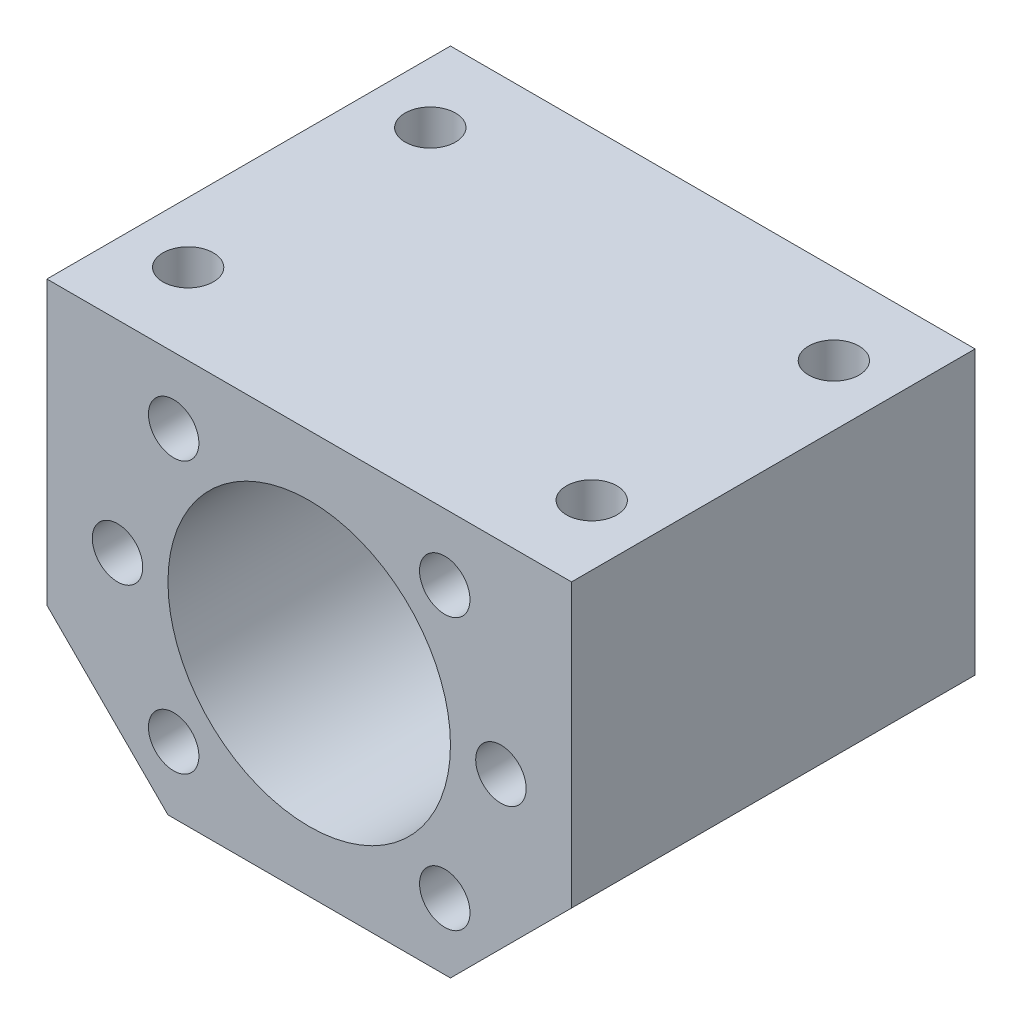
ISO-10303-21;
HEADER;
FILE_DESCRIPTION(('STEP AP214'),'2;1');
FILE_NAME('part.step','',(''),(''),'','','');
FILE_SCHEMA(('AUTOMOTIVE_DESIGN { 1 0 10303 214 1 1 1 1 }'));
ENDSEC;
DATA;
#1=APPLICATION_CONTEXT('core data for automotive mechanical design processes');
#2=APPLICATION_PROTOCOL_DEFINITION('international standard','automotive_design',2000,#1);
#3=PRODUCT_CONTEXT('',#1,'mechanical');
#4=PRODUCT('Part','Part','',(#3));
#5=PRODUCT_RELATED_PRODUCT_CATEGORY('part','',(#4));
#6=PRODUCT_DEFINITION_FORMATION('','',#4);
#7=PRODUCT_DEFINITION_CONTEXT('part definition',#1,'design');
#8=PRODUCT_DEFINITION('design','',#6,#7);
#9=PRODUCT_DEFINITION_SHAPE('','',#8);
#10=(LENGTH_UNIT() NAMED_UNIT(*) SI_UNIT(.MILLI.,.METRE.));
#11=(NAMED_UNIT(*) PLANE_ANGLE_UNIT() SI_UNIT($,.RADIAN.));
#12=(NAMED_UNIT(*) SI_UNIT($,.STERADIAN.) SOLID_ANGLE_UNIT());
#13=UNCERTAINTY_MEASURE_WITH_UNIT(LENGTH_MEASURE(1.E-05),#10,'distance_accuracy_value','');
#14=(GEOMETRIC_REPRESENTATION_CONTEXT(3) GLOBAL_UNCERTAINTY_ASSIGNED_CONTEXT((#13)) GLOBAL_UNIT_ASSIGNED_CONTEXT((#10,
#11,#12)) REPRESENTATION_CONTEXT('',''));
#15=CARTESIAN_POINT('',(0.,0.,0.));
#16=DIRECTION('',(0.,0.,1.));
#17=DIRECTION('',(1.,0.,0.));
#18=AXIS2_PLACEMENT_3D('',#15,#16,#17);
#19=CARTESIAN_POINT('',(0.,0.,40.));
#20=DIRECTION('',(0.,0.,1.));
#21=DIRECTION('',(1.,0.,0.));
#22=AXIS2_PLACEMENT_3D('',#19,#20,#21);
#23=PLANE('',#22);
#24=CARTESIAN_POINT('',(13.4350288425444,13.4350288425444,40.));
#25=DIRECTION('',(0.,0.,1.));
#26=DIRECTION('',(-1.,0.,0.));
#27=AXIS2_PLACEMENT_3D('',#24,#25,#26);
#28=CIRCLE('',#27,2.5);
#29=CARTESIAN_POINT('',(10.9350288425444,13.4350288425444,40.));
#30=VERTEX_POINT('',#29);
#31=EDGE_CURVE('E258',#30,#30,#28,.T.);
#32=ORIENTED_EDGE('',*,*,#31,.F.);
#33=EDGE_LOOP('',(#32));
#34=FACE_BOUND('',#33,.T.);
#35=CARTESIAN_POINT('',(-13.4350288425444,-13.4350288425444,40.));
#36=DIRECTION('',(0.,0.,1.));
#37=DIRECTION('',(-1.,0.,0.));
#38=AXIS2_PLACEMENT_3D('',#35,#36,#37);
#39=CIRCLE('',#38,2.5);
#40=CARTESIAN_POINT('',(-15.9350288425444,-13.4350288425444,40.));
#41=VERTEX_POINT('',#40);
#42=EDGE_CURVE('E270',#41,#41,#39,.T.);
#43=ORIENTED_EDGE('',*,*,#42,.F.);
#44=EDGE_LOOP('',(#43));
#45=FACE_BOUND('',#44,.T.);
#46=CARTESIAN_POINT('',(-19.,0.,40.));
#47=DIRECTION('',(0.,0.,1.));
#48=DIRECTION('',(1.,0.,0.));
#49=AXIS2_PLACEMENT_3D('',#46,#47,#48);
#50=CIRCLE('',#49,2.5);
#51=CARTESIAN_POINT('',(-16.5,0.,40.));
#52=VERTEX_POINT('',#51);
#53=EDGE_CURVE('E282',#52,#52,#50,.T.);
#54=ORIENTED_EDGE('',*,*,#53,.F.);
#55=EDGE_LOOP('',(#54));
#56=FACE_BOUND('',#55,.T.);
#57=DIRECTION('',(0.,-1.,0.));
#58=VECTOR('',#57,1.);
#59=CARTESIAN_POINT('',(-26.,20.,40.));
#60=LINE('',#59,#58);
#61=CARTESIAN_POINT('',(-26.,20.,40.));
#62=VERTEX_POINT('',#61);
#63=CARTESIAN_POINT('',(-26.,-8.,40.));
#64=VERTEX_POINT('',#63);
#65=EDGE_CURVE('E130',#62,#64,#60,.T.);
#66=ORIENTED_EDGE('',*,*,#65,.T.);
#67=DIRECTION('',(0.707106781186548,-0.707106781186547,0.));
#68=VECTOR('',#67,1.);
#69=CARTESIAN_POINT('',(-26.,-8.,40.));
#70=LINE('',#69,#68);
#71=CARTESIAN_POINT('',(-14.,-20.,40.));
#72=VERTEX_POINT('',#71);
#73=EDGE_CURVE('E88',#64,#72,#70,.T.);
#74=ORIENTED_EDGE('',*,*,#73,.T.);
#75=DIRECTION('',(1.,0.,0.));
#76=VECTOR('',#75,1.);
#77=CARTESIAN_POINT('',(-14.,-20.,40.));
#78=LINE('',#77,#76);
#79=CARTESIAN_POINT('',(14.,-20.,40.));
#80=VERTEX_POINT('',#79);
#81=EDGE_CURVE('E101',#72,#80,#78,.T.);
#82=ORIENTED_EDGE('',*,*,#81,.T.);
#83=DIRECTION('',(0.707106781186548,0.707106781186548,0.));
#84=VECTOR('',#83,1.);
#85=CARTESIAN_POINT('',(26.,-7.99999999999999,40.));
#86=LINE('',#85,#84);
#87=CARTESIAN_POINT('',(26.,-7.99999999999999,40.));
#88=VERTEX_POINT('',#87);
#89=EDGE_CURVE('E95',#80,#88,#86,.T.);
#90=ORIENTED_EDGE('',*,*,#89,.T.);
#91=DIRECTION('',(0.,1.,0.));
#92=VECTOR('',#91,1.);
#93=CARTESIAN_POINT('',(26.,20.,40.));
#94=LINE('',#93,#92);
#95=CARTESIAN_POINT('',(26.,20.,40.));
#96=VERTEX_POINT('',#95);
#97=EDGE_CURVE('E99',#88,#96,#94,.T.);
#98=ORIENTED_EDGE('',*,*,#97,.T.);
#99=DIRECTION('',(-1.,0.,0.));
#100=VECTOR('',#99,1.);
#101=CARTESIAN_POINT('',(26.,20.,40.));
#102=LINE('',#101,#100);
#103=EDGE_CURVE('E51',#96,#62,#102,.T.);
#104=ORIENTED_EDGE('',*,*,#103,.T.);
#105=EDGE_LOOP('',(#66,#74,#82,#90,#98,#104));
#106=FACE_BOUND('',#105,.T.);
#107=CARTESIAN_POINT('',(0.,0.,40.));
#108=DIRECTION('',(0.,0.,1.));
#109=DIRECTION('',(1.,0.,0.));
#110=AXIS2_PLACEMENT_3D('',#107,#108,#109);
#111=CIRCLE('',#110,14.);
#112=CARTESIAN_POINT('',(14.,0.,40.));
#113=VERTEX_POINT('',#112);
#114=EDGE_CURVE('E123',#113,#113,#111,.T.);
#115=ORIENTED_EDGE('',*,*,#114,.F.);
#116=EDGE_LOOP('',(#115));
#117=FACE_BOUND('',#116,.T.);
#118=CARTESIAN_POINT('',(-13.4350288425444,13.4350288425444,40.));
#119=DIRECTION('',(0.,0.,1.));
#120=DIRECTION('',(1.,0.,0.));
#121=AXIS2_PLACEMENT_3D('',#118,#119,#120);
#122=CIRCLE('',#121,2.5);
#123=CARTESIAN_POINT('',(-10.9350288425444,13.4350288425444,40.));
#124=VERTEX_POINT('',#123);
#125=EDGE_CURVE('E276',#124,#124,#122,.T.);
#126=ORIENTED_EDGE('',*,*,#125,.F.);
#127=EDGE_LOOP('',(#126));
#128=FACE_BOUND('',#127,.T.);
#129=CARTESIAN_POINT('',(13.4350288425444,-13.4350288425444,40.));
#130=DIRECTION('',(0.,0.,1.));
#131=DIRECTION('',(1.,0.,0.));
#132=AXIS2_PLACEMENT_3D('',#129,#130,#131);
#133=CIRCLE('',#132,2.5);
#134=CARTESIAN_POINT('',(15.9350288425444,-13.4350288425444,40.));
#135=VERTEX_POINT('',#134);
#136=EDGE_CURVE('E264',#135,#135,#133,.T.);
#137=ORIENTED_EDGE('',*,*,#136,.F.);
#138=EDGE_LOOP('',(#137));
#139=FACE_BOUND('',#138,.T.);
#140=CARTESIAN_POINT('',(19.,0.,40.));
#141=DIRECTION('',(0.,0.,1.));
#142=DIRECTION('',(-1.,0.,0.));
#143=AXIS2_PLACEMENT_3D('',#140,#141,#142);
#144=CIRCLE('',#143,2.5);
#145=CARTESIAN_POINT('',(16.5,0.,40.));
#146=VERTEX_POINT('',#145);
#147=EDGE_CURVE('E252',#146,#146,#144,.T.);
#148=ORIENTED_EDGE('',*,*,#147,.F.);
#149=EDGE_LOOP('',(#148));
#150=FACE_BOUND('',#149,.T.);
#151=ADVANCED_FACE('F34',(#34,#45,#56,#106,#117,#128,#139,#150),#23,.T.);
#152=CARTESIAN_POINT('',(0.,0.,0.));
#153=DIRECTION('',(0.,0.,1.));
#154=DIRECTION('',(1.,0.,0.));
#155=AXIS2_PLACEMENT_3D('',#152,#153,#154);
#156=PLANE('',#155);
#157=DIRECTION('',(0.,-1.,0.));
#158=VECTOR('',#157,1.);
#159=CARTESIAN_POINT('',(-26.,20.,0.));
#160=LINE('',#159,#158);
#161=CARTESIAN_POINT('',(-26.,20.,0.));
#162=VERTEX_POINT('',#161);
#163=CARTESIAN_POINT('',(-26.,-8.,0.));
#164=VERTEX_POINT('',#163);
#165=EDGE_CURVE('E119',#162,#164,#160,.T.);
#166=ORIENTED_EDGE('',*,*,#165,.F.);
#167=DIRECTION('',(-1.,0.,0.));
#168=VECTOR('',#167,1.);
#169=CARTESIAN_POINT('',(26.,20.,0.));
#170=LINE('',#169,#168);
#171=CARTESIAN_POINT('',(26.,20.,0.));
#172=VERTEX_POINT('',#171);
#173=EDGE_CURVE('E80',#172,#162,#170,.T.);
#174=ORIENTED_EDGE('',*,*,#173,.F.);
#175=DIRECTION('',(0.,1.,0.));
#176=VECTOR('',#175,1.);
#177=CARTESIAN_POINT('',(26.,20.,0.));
#178=LINE('',#177,#176);
#179=CARTESIAN_POINT('',(26.,-7.99999999999999,0.));
#180=VERTEX_POINT('',#179);
#181=EDGE_CURVE('E74',#180,#172,#178,.T.);
#182=ORIENTED_EDGE('',*,*,#181,.F.);
#183=DIRECTION('',(0.707106781186548,0.707106781186548,0.));
#184=VECTOR('',#183,1.);
#185=CARTESIAN_POINT('',(26.,-7.99999999999999,0.));
#186=LINE('',#185,#184);
#187=CARTESIAN_POINT('',(14.,-20.,0.));
#188=VERTEX_POINT('',#187);
#189=EDGE_CURVE('E109',#188,#180,#186,.T.);
#190=ORIENTED_EDGE('',*,*,#189,.F.);
#191=DIRECTION('',(1.,0.,0.));
#192=VECTOR('',#191,1.);
#193=CARTESIAN_POINT('',(-14.,-20.,0.));
#194=LINE('',#193,#192);
#195=CARTESIAN_POINT('',(-14.,-20.,0.));
#196=VERTEX_POINT('',#195);
#197=EDGE_CURVE('E125',#196,#188,#194,.T.);
#198=ORIENTED_EDGE('',*,*,#197,.F.);
#199=DIRECTION('',(0.707106781186548,-0.707106781186547,0.));
#200=VECTOR('',#199,1.);
#201=CARTESIAN_POINT('',(-26.,-8.,0.));
#202=LINE('',#201,#200);
#203=EDGE_CURVE('E122',#164,#196,#202,.T.);
#204=ORIENTED_EDGE('',*,*,#203,.F.);
#205=EDGE_LOOP('',(#166,#174,#182,#190,#198,#204));
#206=FACE_BOUND('',#205,.T.);
#207=CARTESIAN_POINT('',(0.,0.,0.));
#208=DIRECTION('',(0.,0.,1.));
#209=DIRECTION('',(1.,0.,0.));
#210=AXIS2_PLACEMENT_3D('',#207,#208,#209);
#211=CIRCLE('',#210,14.);
#212=CARTESIAN_POINT('',(14.,0.,0.));
#213=VERTEX_POINT('',#212);
#214=EDGE_CURVE('E285',#213,#213,#211,.T.);
#215=ORIENTED_EDGE('',*,*,#214,.T.);
#216=EDGE_LOOP('',(#215));
#217=FACE_BOUND('',#216,.T.);
#218=CARTESIAN_POINT('',(-19.,0.,0.));
#219=DIRECTION('',(0.,0.,1.));
#220=DIRECTION('',(1.,0.,0.));
#221=AXIS2_PLACEMENT_3D('',#218,#219,#220);
#222=CIRCLE('',#221,2.5);
#223=CARTESIAN_POINT('',(-16.5,0.,0.));
#224=VERTEX_POINT('',#223);
#225=EDGE_CURVE('E279',#224,#224,#222,.T.);
#226=ORIENTED_EDGE('',*,*,#225,.T.);
#227=EDGE_LOOP('',(#226));
#228=FACE_BOUND('',#227,.T.);
#229=CARTESIAN_POINT('',(-13.4350288425444,13.4350288425444,0.));
#230=DIRECTION('',(0.,0.,1.));
#231=DIRECTION('',(1.,0.,0.));
#232=AXIS2_PLACEMENT_3D('',#229,#230,#231);
#233=CIRCLE('',#232,2.5);
#234=CARTESIAN_POINT('',(-10.9350288425444,13.4350288425444,0.));
#235=VERTEX_POINT('',#234);
#236=EDGE_CURVE('E273',#235,#235,#233,.T.);
#237=ORIENTED_EDGE('',*,*,#236,.T.);
#238=EDGE_LOOP('',(#237));
#239=FACE_BOUND('',#238,.T.);
#240=CARTESIAN_POINT('',(-13.4350288425444,-13.4350288425444,0.));
#241=DIRECTION('',(0.,0.,1.));
#242=DIRECTION('',(-1.,0.,0.));
#243=AXIS2_PLACEMENT_3D('',#240,#241,#242);
#244=CIRCLE('',#243,2.5);
#245=CARTESIAN_POINT('',(-15.9350288425444,-13.4350288425444,0.));
#246=VERTEX_POINT('',#245);
#247=EDGE_CURVE('E267',#246,#246,#244,.T.);
#248=ORIENTED_EDGE('',*,*,#247,.T.);
#249=EDGE_LOOP('',(#248));
#250=FACE_BOUND('',#249,.T.);
#251=CARTESIAN_POINT('',(13.4350288425444,-13.4350288425444,0.));
#252=DIRECTION('',(0.,0.,1.));
#253=DIRECTION('',(1.,0.,0.));
#254=AXIS2_PLACEMENT_3D('',#251,#252,#253);
#255=CIRCLE('',#254,2.5);
#256=CARTESIAN_POINT('',(15.9350288425444,-13.4350288425444,0.));
#257=VERTEX_POINT('',#256);
#258=EDGE_CURVE('E261',#257,#257,#255,.T.);
#259=ORIENTED_EDGE('',*,*,#258,.T.);
#260=EDGE_LOOP('',(#259));
#261=FACE_BOUND('',#260,.T.);
#262=CARTESIAN_POINT('',(13.4350288425444,13.4350288425444,0.));
#263=DIRECTION('',(0.,0.,1.));
#264=DIRECTION('',(-1.,0.,0.));
#265=AXIS2_PLACEMENT_3D('',#262,#263,#264);
#266=CIRCLE('',#265,2.5);
#267=CARTESIAN_POINT('',(10.9350288425444,13.4350288425444,0.));
#268=VERTEX_POINT('',#267);
#269=EDGE_CURVE('E255',#268,#268,#266,.T.);
#270=ORIENTED_EDGE('',*,*,#269,.T.);
#271=EDGE_LOOP('',(#270));
#272=FACE_BOUND('',#271,.T.);
#273=CARTESIAN_POINT('',(19.,0.,0.));
#274=DIRECTION('',(0.,0.,1.));
#275=DIRECTION('',(-1.,0.,0.));
#276=AXIS2_PLACEMENT_3D('',#273,#274,#275);
#277=CIRCLE('',#276,2.5);
#278=CARTESIAN_POINT('',(16.5,0.,0.));
#279=VERTEX_POINT('',#278);
#280=EDGE_CURVE('E250',#279,#279,#277,.T.);
#281=ORIENTED_EDGE('',*,*,#280,.T.);
#282=EDGE_LOOP('',(#281));
#283=FACE_BOUND('',#282,.T.);
#284=ADVANCED_FACE('F139',(#206,#217,#228,#239,#250,#261,#272,#283),#156,.F.);
#285=CARTESIAN_POINT('',(-26.,20.,40.));
#286=DIRECTION('',(1.,0.,0.));
#287=DIRECTION('',(0.,1.,0.));
#288=AXIS2_PLACEMENT_3D('',#285,#286,#287);
#289=PLANE('',#288);
#290=ORIENTED_EDGE('',*,*,#165,.T.);
#291=DIRECTION('',(0.,0.,-1.));
#292=VECTOR('',#291,1.);
#293=CARTESIAN_POINT('',(-26.,-8.,40.));
#294=LINE('',#293,#292);
#295=EDGE_CURVE('E11',#64,#164,#294,.T.);
#296=ORIENTED_EDGE('',*,*,#295,.F.);
#297=ORIENTED_EDGE('',*,*,#65,.F.);
#298=DIRECTION('',(0.,0.,-1.));
#299=VECTOR('',#298,1.);
#300=CARTESIAN_POINT('',(-26.,20.,40.));
#301=LINE('',#300,#299);
#302=EDGE_CURVE('E115',#62,#162,#301,.T.);
#303=ORIENTED_EDGE('',*,*,#302,.T.);
#304=EDGE_LOOP('',(#290,#296,#297,#303));
#305=FACE_BOUND('',#304,.T.);
#306=ADVANCED_FACE('F36',(#305),#289,.F.);
#307=CARTESIAN_POINT('',(-26.,-8.,40.));
#308=DIRECTION('',(0.707106781186547,0.707106781186548,0.));
#309=DIRECTION('',(-0.707106781186548,0.707106781186547,0.));
#310=AXIS2_PLACEMENT_3D('',#307,#308,#309);
#311=PLANE('',#310);
#312=ORIENTED_EDGE('',*,*,#203,.T.);
#313=DIRECTION('',(0.,0.,-1.));
#314=VECTOR('',#313,1.);
#315=CARTESIAN_POINT('',(-14.,-20.,40.));
#316=LINE('',#315,#314);
#317=EDGE_CURVE('E43',#72,#196,#316,.T.);
#318=ORIENTED_EDGE('',*,*,#317,.F.);
#319=ORIENTED_EDGE('',*,*,#73,.F.);
#320=ORIENTED_EDGE('',*,*,#295,.T.);
#321=EDGE_LOOP('',(#312,#318,#319,#320));
#322=FACE_BOUND('',#321,.T.);
#323=ADVANCED_FACE('F436',(#322),#311,.F.);
#324=CARTESIAN_POINT('',(-14.,-20.,40.));
#325=DIRECTION('',(0.,1.,0.));
#326=DIRECTION('',(-1.,0.,0.));
#327=AXIS2_PLACEMENT_3D('',#324,#325,#326);
#328=PLANE('',#327);
#329=ORIENTED_EDGE('',*,*,#197,.T.);
#330=DIRECTION('',(0.,0.,-1.));
#331=VECTOR('',#330,1.);
#332=CARTESIAN_POINT('',(14.,-20.,40.));
#333=LINE('',#332,#331);
#334=EDGE_CURVE('E110',#80,#188,#333,.T.);
#335=ORIENTED_EDGE('',*,*,#334,.F.);
#336=ORIENTED_EDGE('',*,*,#81,.F.);
#337=ORIENTED_EDGE('',*,*,#317,.T.);
#338=EDGE_LOOP('',(#329,#335,#336,#337));
#339=FACE_BOUND('',#338,.T.);
#340=ADVANCED_FACE('F136',(#339),#328,.F.);
#341=CARTESIAN_POINT('',(26.,-7.99999999999999,40.));
#342=DIRECTION('',(-0.707106781186548,0.707106781186548,0.));
#343=DIRECTION('',(-0.707106781186548,-0.707106781186548,0.));
#344=AXIS2_PLACEMENT_3D('',#341,#342,#343);
#345=PLANE('',#344);
#346=ORIENTED_EDGE('',*,*,#189,.T.);
#347=DIRECTION('',(0.,0.,-1.));
#348=VECTOR('',#347,1.);
#349=CARTESIAN_POINT('',(26.,-7.99999999999999,40.));
#350=LINE('',#349,#348);
#351=EDGE_CURVE('E106',#88,#180,#350,.T.);
#352=ORIENTED_EDGE('',*,*,#351,.F.);
#353=ORIENTED_EDGE('',*,*,#89,.F.);
#354=ORIENTED_EDGE('',*,*,#334,.T.);
#355=EDGE_LOOP('',(#346,#352,#353,#354));
#356=FACE_BOUND('',#355,.T.);
#357=ADVANCED_FACE('F107',(#356),#345,.F.);
#358=CARTESIAN_POINT('',(26.,20.,40.));
#359=DIRECTION('',(-1.,0.,0.));
#360=DIRECTION('',(0.,-1.,0.));
#361=AXIS2_PLACEMENT_3D('',#358,#359,#360);
#362=PLANE('',#361);
#363=ORIENTED_EDGE('',*,*,#181,.T.);
#364=DIRECTION('',(0.,0.,-1.));
#365=VECTOR('',#364,1.);
#366=CARTESIAN_POINT('',(26.,20.,40.));
#367=LINE('',#366,#365);
#368=EDGE_CURVE('E111',#96,#172,#367,.T.);
#369=ORIENTED_EDGE('',*,*,#368,.F.);
#370=ORIENTED_EDGE('',*,*,#97,.F.);
#371=ORIENTED_EDGE('',*,*,#351,.T.);
#372=EDGE_LOOP('',(#363,#369,#370,#371));
#373=FACE_BOUND('',#372,.T.);
#374=ADVANCED_FACE('F113',(#373),#362,.F.);
#375=CARTESIAN_POINT('',(26.,20.,40.));
#376=DIRECTION('',(0.,-1.,0.));
#377=DIRECTION('',(1.,0.,0.));
#378=AXIS2_PLACEMENT_3D('',#375,#376,#377);
#379=PLANE('',#378);
#380=CARTESIAN_POINT('',(20.,20.,8.));
#381=DIRECTION('',(0.,1.,0.));
#382=DIRECTION('',(1.,0.,0.));
#383=AXIS2_PLACEMENT_3D('',#380,#381,#382);
#384=CIRCLE('',#383,2.5);
#385=CARTESIAN_POINT('',(22.5,20.,8.));
#386=VERTEX_POINT('',#385);
#387=EDGE_CURVE('E246',#386,#386,#384,.T.);
#388=ORIENTED_EDGE('',*,*,#387,.F.);
#389=EDGE_LOOP('',(#388));
#390=FACE_BOUND('',#389,.T.);
#391=CARTESIAN_POINT('',(20.,20.,32.));
#392=DIRECTION('',(0.,1.,0.));
#393=DIRECTION('',(1.,0.,0.));
#394=AXIS2_PLACEMENT_3D('',#391,#392,#393);
#395=CIRCLE('',#394,2.5);
#396=CARTESIAN_POINT('',(22.5,20.,32.));
#397=VERTEX_POINT('',#396);
#398=EDGE_CURVE('E240',#397,#397,#395,.T.);
#399=ORIENTED_EDGE('',*,*,#398,.F.);
#400=EDGE_LOOP('',(#399));
#401=FACE_BOUND('',#400,.T.);
#402=CARTESIAN_POINT('',(-20.,20.,32.));
#403=DIRECTION('',(0.,1.,0.));
#404=DIRECTION('',(-1.,0.,0.));
#405=AXIS2_PLACEMENT_3D('',#402,#403,#404);
#406=CIRCLE('',#405,2.5);
#407=CARTESIAN_POINT('',(-22.5,20.,32.));
#408=VERTEX_POINT('',#407);
#409=EDGE_CURVE('E229',#408,#408,#406,.T.);
#410=ORIENTED_EDGE('',*,*,#409,.F.);
#411=EDGE_LOOP('',(#410));
#412=FACE_BOUND('',#411,.T.);
#413=CARTESIAN_POINT('',(-20.,20.,8.00000000000001));
#414=DIRECTION('',(0.,1.,0.));
#415=DIRECTION('',(-1.,0.,0.));
#416=AXIS2_PLACEMENT_3D('',#413,#414,#415);
#417=CIRCLE('',#416,2.5);
#418=CARTESIAN_POINT('',(-22.5,20.,8.00000000000001));
#419=VERTEX_POINT('',#418);
#420=EDGE_CURVE('E228',#419,#419,#417,.T.);
#421=ORIENTED_EDGE('',*,*,#420,.F.);
#422=EDGE_LOOP('',(#421));
#423=FACE_BOUND('',#422,.T.);
#424=ORIENTED_EDGE('',*,*,#173,.T.);
#425=ORIENTED_EDGE('',*,*,#302,.F.);
#426=ORIENTED_EDGE('',*,*,#103,.F.);
#427=ORIENTED_EDGE('',*,*,#368,.T.);
#428=EDGE_LOOP('',(#424,#425,#426,#427));
#429=FACE_BOUND('',#428,.T.);
#430=ADVANCED_FACE('F144',(#390,#401,#412,#423,#429),#379,.F.);
#431=CARTESIAN_POINT('',(0.,0.,40.));
#432=DIRECTION('',(0.,0.,-1.));
#433=DIRECTION('',(-1.,0.,0.));
#434=AXIS2_PLACEMENT_3D('',#431,#432,#433);
#435=CYLINDRICAL_SURFACE('',#434,14.);
#436=ORIENTED_EDGE('',*,*,#114,.T.);
#437=EDGE_LOOP('',(#436));
#438=FACE_BOUND('',#437,.T.);
#439=ORIENTED_EDGE('',*,*,#214,.F.);
#440=EDGE_LOOP('',(#439));
#441=FACE_BOUND('',#440,.T.);
#442=ADVANCED_FACE('F146',(#438,#441),#435,.F.);
#443=CARTESIAN_POINT('',(-19.,0.,40.));
#444=DIRECTION('',(0.,0.,-1.));
#445=DIRECTION('',(-1.,0.,0.));
#446=AXIS2_PLACEMENT_3D('',#443,#444,#445);
#447=CYLINDRICAL_SURFACE('',#446,2.5);
#448=ORIENTED_EDGE('',*,*,#53,.T.);
#449=EDGE_LOOP('',(#448));
#450=FACE_BOUND('',#449,.T.);
#451=ORIENTED_EDGE('',*,*,#225,.F.);
#452=EDGE_LOOP('',(#451));
#453=FACE_BOUND('',#452,.T.);
#454=ADVANCED_FACE('F153',(#450,#453),#447,.F.);
#455=CARTESIAN_POINT('',(-13.4350288425444,13.4350288425444,40.));
#456=DIRECTION('',(0.,0.,-1.));
#457=DIRECTION('',(-1.,0.,0.));
#458=AXIS2_PLACEMENT_3D('',#455,#456,#457);
#459=CYLINDRICAL_SURFACE('',#458,2.5);
#460=ORIENTED_EDGE('',*,*,#125,.T.);
#461=EDGE_LOOP('',(#460));
#462=FACE_BOUND('',#461,.T.);
#463=ORIENTED_EDGE('',*,*,#236,.F.);
#464=EDGE_LOOP('',(#463));
#465=FACE_BOUND('',#464,.T.);
#466=ADVANCED_FACE('F171',(#462,#465),#459,.F.);
#467=CARTESIAN_POINT('',(-13.4350288425444,-13.4350288425444,40.));
#468=DIRECTION('',(0.,0.,-1.));
#469=DIRECTION('',(-1.,0.,0.));
#470=AXIS2_PLACEMENT_3D('',#467,#468,#469);
#471=CYLINDRICAL_SURFACE('',#470,2.5);
#472=ORIENTED_EDGE('',*,*,#42,.T.);
#473=EDGE_LOOP('',(#472));
#474=FACE_BOUND('',#473,.T.);
#475=ORIENTED_EDGE('',*,*,#247,.F.);
#476=EDGE_LOOP('',(#475));
#477=FACE_BOUND('',#476,.T.);
#478=ADVANCED_FACE('F175',(#474,#477),#471,.F.);
#479=CARTESIAN_POINT('',(13.4350288425444,-13.4350288425444,40.));
#480=DIRECTION('',(0.,0.,-1.));
#481=DIRECTION('',(-1.,0.,0.));
#482=AXIS2_PLACEMENT_3D('',#479,#480,#481);
#483=CYLINDRICAL_SURFACE('',#482,2.5);
#484=ORIENTED_EDGE('',*,*,#136,.T.);
#485=EDGE_LOOP('',(#484));
#486=FACE_BOUND('',#485,.T.);
#487=ORIENTED_EDGE('',*,*,#258,.F.);
#488=EDGE_LOOP('',(#487));
#489=FACE_BOUND('',#488,.T.);
#490=ADVANCED_FACE('F179',(#486,#489),#483,.F.);
#491=CARTESIAN_POINT('',(13.4350288425444,13.4350288425444,40.));
#492=DIRECTION('',(0.,0.,-1.));
#493=DIRECTION('',(-1.,0.,0.));
#494=AXIS2_PLACEMENT_3D('',#491,#492,#493);
#495=CYLINDRICAL_SURFACE('',#494,2.5);
#496=ORIENTED_EDGE('',*,*,#31,.T.);
#497=EDGE_LOOP('',(#496));
#498=FACE_BOUND('',#497,.T.);
#499=ORIENTED_EDGE('',*,*,#269,.F.);
#500=EDGE_LOOP('',(#499));
#501=FACE_BOUND('',#500,.T.);
#502=ADVANCED_FACE('F183',(#498,#501),#495,.F.);
#503=CARTESIAN_POINT('',(19.,0.,40.));
#504=DIRECTION('',(0.,0.,-1.));
#505=DIRECTION('',(-1.,0.,0.));
#506=AXIS2_PLACEMENT_3D('',#503,#504,#505);
#507=CYLINDRICAL_SURFACE('',#506,2.5);
#508=ORIENTED_EDGE('',*,*,#147,.T.);
#509=EDGE_LOOP('',(#508));
#510=FACE_BOUND('',#509,.T.);
#511=ORIENTED_EDGE('',*,*,#280,.F.);
#512=EDGE_LOOP('',(#511));
#513=FACE_BOUND('',#512,.T.);
#514=ADVANCED_FACE('F187',(#510,#513),#507,.F.);
#515=CARTESIAN_POINT('',(-20.,10.,8.00000000000001));
#516=DIRECTION('',(0.,1.,0.));
#517=DIRECTION('',(-1.,0.,0.));
#518=AXIS2_PLACEMENT_3D('',#515,#516,#517);
#519=CYLINDRICAL_SURFACE('',#518,2.5);
#520=CARTESIAN_POINT('',(-20.,10.,8.00000000000001));
#521=DIRECTION('',(0.,1.,0.));
#522=DIRECTION('',(-1.,0.,0.));
#523=AXIS2_PLACEMENT_3D('',#520,#521,#522);
#524=CIRCLE('',#523,2.5);
#525=CARTESIAN_POINT('',(-22.5,10.,8.00000000000001));
#526=VERTEX_POINT('',#525);
#527=EDGE_CURVE('E232',#526,#526,#524,.T.);
#528=ORIENTED_EDGE('',*,*,#527,.F.);
#529=EDGE_LOOP('',(#528));
#530=FACE_BOUND('',#529,.T.);
#531=ORIENTED_EDGE('',*,*,#420,.T.);
#532=EDGE_LOOP('',(#531));
#533=FACE_BOUND('',#532,.T.);
#534=ADVANCED_FACE('F191',(#530,#533),#519,.F.);
#535=CARTESIAN_POINT('',(-20.,10.,8.00000000000001));
#536=DIRECTION('',(0.,1.,0.));
#537=DIRECTION('',(-1.,0.,0.));
#538=AXIS2_PLACEMENT_3D('',#535,#536,#537);
#539=PLANE('',#538);
#540=ORIENTED_EDGE('',*,*,#527,.T.);
#541=EDGE_LOOP('',(#540));
#542=FACE_BOUND('',#541,.T.);
#543=ADVANCED_FACE('F195',(#542),#539,.T.);
#544=CARTESIAN_POINT('',(-20.,10.,32.));
#545=DIRECTION('',(0.,1.,0.));
#546=DIRECTION('',(-1.,0.,0.));
#547=AXIS2_PLACEMENT_3D('',#544,#545,#546);
#548=CYLINDRICAL_SURFACE('',#547,2.5);
#549=CARTESIAN_POINT('',(-20.,10.,32.));
#550=DIRECTION('',(0.,1.,0.));
#551=DIRECTION('',(-1.,0.,0.));
#552=AXIS2_PLACEMENT_3D('',#549,#550,#551);
#553=CIRCLE('',#552,2.5);
#554=CARTESIAN_POINT('',(-22.5,10.,32.));
#555=VERTEX_POINT('',#554);
#556=EDGE_CURVE('E227',#555,#555,#553,.T.);
#557=ORIENTED_EDGE('',*,*,#556,.F.);
#558=EDGE_LOOP('',(#557));
#559=FACE_BOUND('',#558,.T.);
#560=ORIENTED_EDGE('',*,*,#409,.T.);
#561=EDGE_LOOP('',(#560));
#562=FACE_BOUND('',#561,.T.);
#563=ADVANCED_FACE('F199',(#559,#562),#548,.F.);
#564=CARTESIAN_POINT('',(-20.,10.,32.));
#565=DIRECTION('',(0.,1.,0.));
#566=DIRECTION('',(-1.,0.,0.));
#567=AXIS2_PLACEMENT_3D('',#564,#565,#566);
#568=PLANE('',#567);
#569=ORIENTED_EDGE('',*,*,#556,.T.);
#570=EDGE_LOOP('',(#569));
#571=FACE_BOUND('',#570,.T.);
#572=ADVANCED_FACE('F213',(#571),#568,.T.);
#573=CARTESIAN_POINT('',(20.,10.,32.));
#574=DIRECTION('',(0.,1.,0.));
#575=DIRECTION('',(-1.,0.,0.));
#576=AXIS2_PLACEMENT_3D('',#573,#574,#575);
#577=CYLINDRICAL_SURFACE('',#576,2.5);
#578=CARTESIAN_POINT('',(20.,10.,32.));
#579=DIRECTION('',(0.,1.,0.));
#580=DIRECTION('',(1.,0.,0.));
#581=AXIS2_PLACEMENT_3D('',#578,#579,#580);
#582=CIRCLE('',#581,2.5);
#583=CARTESIAN_POINT('',(22.5,10.,32.));
#584=VERTEX_POINT('',#583);
#585=EDGE_CURVE('E235',#584,#584,#582,.T.);
#586=ORIENTED_EDGE('',*,*,#585,.F.);
#587=EDGE_LOOP('',(#586));
#588=FACE_BOUND('',#587,.T.);
#589=ORIENTED_EDGE('',*,*,#398,.T.);
#590=EDGE_LOOP('',(#589));
#591=FACE_BOUND('',#590,.T.);
#592=ADVANCED_FACE('F210',(#588,#591),#577,.F.);
#593=CARTESIAN_POINT('',(20.,10.,32.));
#594=DIRECTION('',(0.,-1.,0.));
#595=DIRECTION('',(1.,0.,0.));
#596=AXIS2_PLACEMENT_3D('',#593,#594,#595);
#597=PLANE('',#596);
#598=ORIENTED_EDGE('',*,*,#585,.T.);
#599=EDGE_LOOP('',(#598));
#600=FACE_BOUND('',#599,.T.);
#601=ADVANCED_FACE('F205',(#600),#597,.F.);
#602=CARTESIAN_POINT('',(20.,10.,8.));
#603=DIRECTION('',(0.,1.,0.));
#604=DIRECTION('',(-1.,0.,0.));
#605=AXIS2_PLACEMENT_3D('',#602,#603,#604);
#606=CYLINDRICAL_SURFACE('',#605,2.5);
#607=CARTESIAN_POINT('',(20.,10.,8.));
#608=DIRECTION('',(0.,1.,0.));
#609=DIRECTION('',(1.,0.,0.));
#610=AXIS2_PLACEMENT_3D('',#607,#608,#609);
#611=CIRCLE('',#610,2.5);
#612=CARTESIAN_POINT('',(22.5,10.,8.));
#613=VERTEX_POINT('',#612);
#614=EDGE_CURVE('E243',#613,#613,#611,.T.);
#615=ORIENTED_EDGE('',*,*,#614,.F.);
#616=EDGE_LOOP('',(#615));
#617=FACE_BOUND('',#616,.T.);
#618=ORIENTED_EDGE('',*,*,#387,.T.);
#619=EDGE_LOOP('',(#618));
#620=FACE_BOUND('',#619,.T.);
#621=ADVANCED_FACE('F201',(#617,#620),#606,.F.);
#622=CARTESIAN_POINT('',(20.,10.,8.));
#623=DIRECTION('',(0.,-1.,0.));
#624=DIRECTION('',(1.,0.,0.));
#625=AXIS2_PLACEMENT_3D('',#622,#623,#624);
#626=PLANE('',#625);
#627=ORIENTED_EDGE('',*,*,#614,.T.);
#628=EDGE_LOOP('',(#627));
#629=FACE_BOUND('',#628,.T.);
#630=ADVANCED_FACE('F204',(#629),#626,.F.);
#631=CLOSED_SHELL('',(#151,#284,#306,#323,#340,#357,#374,#430,#442,#454,#466,#478,#490,#502,
#514,#534,#543,#563,#572,#592,#601,#621,#630));
#632=MANIFOLD_SOLID_BREP('B2',#631);
#633=ADVANCED_BREP_SHAPE_REPRESENTATION('',(#18,#632),#14);
#634=SHAPE_DEFINITION_REPRESENTATION(#9,#633);
ENDSEC;
END-ISO-10303-21;
